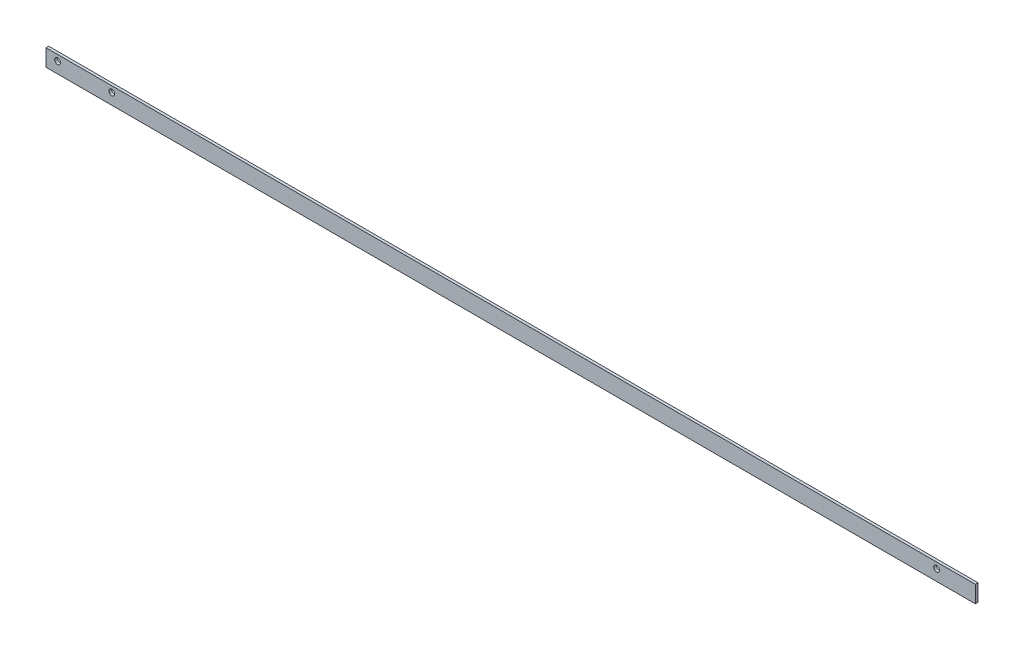
ISO-10303-21;
HEADER;
FILE_DESCRIPTION(('STEP AP214'),'2;1');
FILE_NAME('part.step','',(''),(''),'','','');
FILE_SCHEMA(('AUTOMOTIVE_DESIGN { 1 0 10303 214 1 1 1 1 }'));
ENDSEC;
DATA;
#1=APPLICATION_CONTEXT('core data for automotive mechanical design processes');
#2=APPLICATION_PROTOCOL_DEFINITION('international standard','automotive_design',2000,#1);
#3=PRODUCT_CONTEXT('',#1,'mechanical');
#4=PRODUCT('Part','Part','',(#3));
#5=PRODUCT_RELATED_PRODUCT_CATEGORY('part','',(#4));
#6=PRODUCT_DEFINITION_FORMATION('','',#4);
#7=PRODUCT_DEFINITION_CONTEXT('part definition',#1,'design');
#8=PRODUCT_DEFINITION('design','',#6,#7);
#9=PRODUCT_DEFINITION_SHAPE('','',#8);
#10=(LENGTH_UNIT() NAMED_UNIT(*) SI_UNIT(.MILLI.,.METRE.));
#11=(NAMED_UNIT(*) PLANE_ANGLE_UNIT() SI_UNIT($,.RADIAN.));
#12=(NAMED_UNIT(*) SI_UNIT($,.STERADIAN.) SOLID_ANGLE_UNIT());
#13=UNCERTAINTY_MEASURE_WITH_UNIT(LENGTH_MEASURE(1.E-05),#10,'distance_accuracy_value','');
#14=(GEOMETRIC_REPRESENTATION_CONTEXT(3) GLOBAL_UNCERTAINTY_ASSIGNED_CONTEXT((#13)) GLOBAL_UNIT_ASSIGNED_CONTEXT((#10,
#11,#12)) REPRESENTATION_CONTEXT('',''));
#15=CARTESIAN_POINT('',(0.,0.,0.));
#16=DIRECTION('',(0.,0.,1.));
#17=DIRECTION('',(1.,0.,0.));
#18=AXIS2_PLACEMENT_3D('',#15,#16,#17);
#19=CARTESIAN_POINT('',(304.800000000001,-5.54990000000001,0.889));
#20=DIRECTION('',(-1.,0.,0.));
#21=DIRECTION('',(0.,0.,1.));
#22=AXIS2_PLACEMENT_3D('',#19,#20,#21);
#23=PLANE('',#22);
#24=DIRECTION('',(0.,1.,0.));
#25=VECTOR('',#24,1.);
#26=CARTESIAN_POINT('',(304.800000000001,-5.54990000000001,-0.889));
#27=LINE('',#26,#25);
#28=CARTESIAN_POINT('',(304.800000000001,-5.54990000000001,-0.889));
#29=VERTEX_POINT('',#28);
#30=CARTESIAN_POINT('',(304.800000000001,5.54989999999998,-0.889));
#31=VERTEX_POINT('',#30);
#32=EDGE_CURVE('E110',#29,#31,#27,.T.);
#33=ORIENTED_EDGE('',*,*,#32,.T.);
#34=DIRECTION('',(0.,0.,-1.));
#35=VECTOR('',#34,1.);
#36=CARTESIAN_POINT('',(304.800000000001,5.54989999999998,0.889));
#37=LINE('',#36,#35);
#38=CARTESIAN_POINT('',(304.800000000001,5.54989999999998,0.889));
#39=VERTEX_POINT('',#38);
#40=EDGE_CURVE('E11',#39,#31,#37,.T.);
#41=ORIENTED_EDGE('',*,*,#40,.F.);
#42=DIRECTION('',(0.,1.,0.));
#43=VECTOR('',#42,1.);
#44=CARTESIAN_POINT('',(304.800000000001,-5.54990000000001,0.889));
#45=LINE('',#44,#43);
#46=CARTESIAN_POINT('',(304.800000000001,-5.54990000000001,0.889));
#47=VERTEX_POINT('',#46);
#48=EDGE_CURVE('E94',#47,#39,#45,.T.);
#49=ORIENTED_EDGE('',*,*,#48,.F.);
#50=DIRECTION('',(0.,0.,-1.));
#51=VECTOR('',#50,1.);
#52=CARTESIAN_POINT('',(304.800000000001,-5.54990000000001,0.889));
#53=LINE('',#52,#51);
#54=EDGE_CURVE('E106',#47,#29,#53,.T.);
#55=ORIENTED_EDGE('',*,*,#54,.T.);
#56=EDGE_LOOP('',(#33,#41,#49,#55));
#57=FACE_BOUND('',#56,.T.);
#58=ADVANCED_FACE('F42',(#57),#23,.F.);
#59=CARTESIAN_POINT('',(-304.799999999999,5.54989999999998,0.889));
#60=DIRECTION('',(0.,-1.,0.));
#61=DIRECTION('',(0.,0.,-1.));
#62=AXIS2_PLACEMENT_3D('',#59,#60,#61);
#63=PLANE('',#62);
#64=DIRECTION('',(-1.,0.,0.));
#65=VECTOR('',#64,1.);
#66=CARTESIAN_POINT('',(-304.799999999999,5.54989999999998,-0.889));
#67=LINE('',#66,#65);
#68=CARTESIAN_POINT('',(-304.799999999999,5.54989999999998,-0.889));
#69=VERTEX_POINT('',#68);
#70=EDGE_CURVE('E99',#31,#69,#67,.T.);
#71=ORIENTED_EDGE('',*,*,#70,.T.);
#72=DIRECTION('',(0.,0.,-1.));
#73=VECTOR('',#72,1.);
#74=CARTESIAN_POINT('',(-304.799999999999,5.54989999999998,0.889));
#75=LINE('',#74,#73);
#76=CARTESIAN_POINT('',(-304.799999999999,5.54989999999998,0.889));
#77=VERTEX_POINT('',#76);
#78=EDGE_CURVE('E51',#77,#69,#75,.T.);
#79=ORIENTED_EDGE('',*,*,#78,.F.);
#80=DIRECTION('',(-1.,0.,0.));
#81=VECTOR('',#80,1.);
#82=CARTESIAN_POINT('',(-304.799999999999,5.54989999999998,0.889));
#83=LINE('',#82,#81);
#84=EDGE_CURVE('E89',#39,#77,#83,.T.);
#85=ORIENTED_EDGE('',*,*,#84,.F.);
#86=ORIENTED_EDGE('',*,*,#40,.T.);
#87=EDGE_LOOP('',(#71,#79,#85,#86));
#88=FACE_BOUND('',#87,.T.);
#89=ADVANCED_FACE('F98',(#88),#63,.F.);
#90=CARTESIAN_POINT('',(-304.799999999999,-5.54989999999998,0.889));
#91=DIRECTION('',(1.,0.,0.));
#92=DIRECTION('',(0.,0.,-1.));
#93=AXIS2_PLACEMENT_3D('',#90,#91,#92);
#94=PLANE('',#93);
#95=DIRECTION('',(0.,-1.,0.));
#96=VECTOR('',#95,1.);
#97=CARTESIAN_POINT('',(-304.799999999999,-5.54989999999998,-0.889));
#98=LINE('',#97,#96);
#99=CARTESIAN_POINT('',(-304.799999999999,-5.54989999999998,-0.889));
#100=VERTEX_POINT('',#99);
#101=EDGE_CURVE('E76',#69,#100,#98,.T.);
#102=ORIENTED_EDGE('',*,*,#101,.T.);
#103=DIRECTION('',(0.,0.,-1.));
#104=VECTOR('',#103,1.);
#105=CARTESIAN_POINT('',(-304.799999999999,-5.54989999999998,0.889));
#106=LINE('',#105,#104);
#107=CARTESIAN_POINT('',(-304.799999999999,-5.54989999999998,0.889));
#108=VERTEX_POINT('',#107);
#109=EDGE_CURVE('E101',#108,#100,#106,.T.);
#110=ORIENTED_EDGE('',*,*,#109,.F.);
#111=DIRECTION('',(0.,-1.,0.));
#112=VECTOR('',#111,1.);
#113=CARTESIAN_POINT('',(-304.799999999999,-5.54989999999998,0.889));
#114=LINE('',#113,#112);
#115=EDGE_CURVE('E92',#77,#108,#114,.T.);
#116=ORIENTED_EDGE('',*,*,#115,.F.);
#117=ORIENTED_EDGE('',*,*,#78,.T.);
#118=EDGE_LOOP('',(#102,#110,#116,#117));
#119=FACE_BOUND('',#118,.T.);
#120=ADVANCED_FACE('F102',(#119),#94,.F.);
#121=CARTESIAN_POINT('',(-304.799999999999,-5.54989999999998,0.889));
#122=DIRECTION('',(0.,1.,0.));
#123=DIRECTION('',(-1.,0.,0.));
#124=AXIS2_PLACEMENT_3D('',#121,#122,#123);
#125=PLANE('',#124);
#126=DIRECTION('',(1.,0.,0.));
#127=VECTOR('',#126,1.);
#128=CARTESIAN_POINT('',(-304.799999999999,-5.54989999999998,-0.889));
#129=LINE('',#128,#127);
#130=EDGE_CURVE('E82',#100,#29,#129,.T.);
#131=ORIENTED_EDGE('',*,*,#130,.T.);
#132=ORIENTED_EDGE('',*,*,#54,.F.);
#133=DIRECTION('',(1.,0.,0.));
#134=VECTOR('',#133,1.);
#135=CARTESIAN_POINT('',(-304.799999999999,-5.54989999999998,0.889));
#136=LINE('',#135,#134);
#137=EDGE_CURVE('E59',#108,#47,#136,.T.);
#138=ORIENTED_EDGE('',*,*,#137,.F.);
#139=ORIENTED_EDGE('',*,*,#109,.T.);
#140=EDGE_LOOP('',(#131,#132,#138,#139));
#141=FACE_BOUND('',#140,.T.);
#142=ADVANCED_FACE('F124',(#141),#125,.F.);
#143=CARTESIAN_POINT('',(0.,0.,0.889));
#144=DIRECTION('',(0.,0.,-1.));
#145=DIRECTION('',(-1.,0.,0.));
#146=AXIS2_PLACEMENT_3D('',#143,#144,#145);
#147=PLANE('',#146);
#148=CARTESIAN_POINT('',(-297.179999999999,1.73989999999998,0.889));
#149=DIRECTION('',(0.,0.,1.));
#150=DIRECTION('',(1.,0.,0.));
#151=AXIS2_PLACEMENT_3D('',#148,#149,#150);
#152=CIRCLE('',#151,1.89865);
#153=CARTESIAN_POINT('',(-295.281349999999,1.73989999999998,0.889));
#154=VERTEX_POINT('',#153);
#155=EDGE_CURVE('E150',#154,#154,#152,.T.);
#156=ORIENTED_EDGE('',*,*,#155,.F.);
#157=EDGE_LOOP('',(#156));
#158=FACE_BOUND('',#157,.T.);
#159=CARTESIAN_POINT('',(-261.619999999999,1.73989999999998,0.889));
#160=DIRECTION('',(0.,0.,1.));
#161=DIRECTION('',(1.,0.,0.));
#162=AXIS2_PLACEMENT_3D('',#159,#160,#161);
#163=CIRCLE('',#162,1.89865);
#164=CARTESIAN_POINT('',(-259.721349999999,1.73989999999998,0.889));
#165=VERTEX_POINT('',#164);
#166=EDGE_CURVE('E142',#165,#165,#163,.T.);
#167=ORIENTED_EDGE('',*,*,#166,.F.);
#168=EDGE_LOOP('',(#167));
#169=FACE_BOUND('',#168,.T.);
#170=CARTESIAN_POINT('',(279.400000000001,1.73989999999998,0.889));
#171=DIRECTION('',(0.,0.,1.));
#172=DIRECTION('',(1.,0.,0.));
#173=AXIS2_PLACEMENT_3D('',#170,#171,#172);
#174=CIRCLE('',#173,1.89865);
#175=CARTESIAN_POINT('',(281.298650000001,1.73989999999998,0.889));
#176=VERTEX_POINT('',#175);
#177=EDGE_CURVE('E134',#176,#176,#174,.T.);
#178=ORIENTED_EDGE('',*,*,#177,.F.);
#179=EDGE_LOOP('',(#178));
#180=FACE_BOUND('',#179,.T.);
#181=ORIENTED_EDGE('',*,*,#48,.T.);
#182=ORIENTED_EDGE('',*,*,#84,.T.);
#183=ORIENTED_EDGE('',*,*,#115,.T.);
#184=ORIENTED_EDGE('',*,*,#137,.T.);
#185=EDGE_LOOP('',(#181,#182,#183,#184));
#186=FACE_BOUND('',#185,.T.);
#187=ADVANCED_FACE('F90',(#158,#169,#180,#186),#147,.F.);
#188=CARTESIAN_POINT('',(0.,0.,-0.889));
#189=DIRECTION('',(0.,0.,-1.));
#190=DIRECTION('',(-1.,0.,0.));
#191=AXIS2_PLACEMENT_3D('',#188,#189,#190);
#192=PLANE('',#191);
#193=CARTESIAN_POINT('',(-297.179999999999,1.73989999999998,-0.889));
#194=DIRECTION('',(0.,0.,1.));
#195=DIRECTION('',(1.,0.,0.));
#196=AXIS2_PLACEMENT_3D('',#193,#194,#195);
#197=CIRCLE('',#196,1.89865);
#198=CARTESIAN_POINT('',(-295.281349999999,1.73989999999998,-0.889));
#199=VERTEX_POINT('',#198);
#200=EDGE_CURVE('E146',#199,#199,#197,.T.);
#201=ORIENTED_EDGE('',*,*,#200,.T.);
#202=EDGE_LOOP('',(#201));
#203=FACE_BOUND('',#202,.T.);
#204=CARTESIAN_POINT('',(-261.619999999999,1.73989999999998,-0.889));
#205=DIRECTION('',(0.,0.,1.));
#206=DIRECTION('',(1.,0.,0.));
#207=AXIS2_PLACEMENT_3D('',#204,#205,#206);
#208=CIRCLE('',#207,1.89865);
#209=CARTESIAN_POINT('',(-259.721349999999,1.73989999999998,-0.889));
#210=VERTEX_POINT('',#209);
#211=EDGE_CURVE('E138',#210,#210,#208,.T.);
#212=ORIENTED_EDGE('',*,*,#211,.T.);
#213=EDGE_LOOP('',(#212));
#214=FACE_BOUND('',#213,.T.);
#215=CARTESIAN_POINT('',(279.400000000001,1.73989999999998,-0.889));
#216=DIRECTION('',(0.,0.,1.));
#217=DIRECTION('',(1.,0.,0.));
#218=AXIS2_PLACEMENT_3D('',#215,#216,#217);
#219=CIRCLE('',#218,1.89865);
#220=CARTESIAN_POINT('',(281.298650000001,1.73989999999998,-0.889));
#221=VERTEX_POINT('',#220);
#222=EDGE_CURVE('E114',#221,#221,#219,.T.);
#223=ORIENTED_EDGE('',*,*,#222,.T.);
#224=EDGE_LOOP('',(#223));
#225=FACE_BOUND('',#224,.T.);
#226=ORIENTED_EDGE('',*,*,#32,.F.);
#227=ORIENTED_EDGE('',*,*,#130,.F.);
#228=ORIENTED_EDGE('',*,*,#101,.F.);
#229=ORIENTED_EDGE('',*,*,#70,.F.);
#230=EDGE_LOOP('',(#226,#227,#228,#229));
#231=FACE_BOUND('',#230,.T.);
#232=ADVANCED_FACE('F127',(#203,#214,#225,#231),#192,.T.);
#233=CARTESIAN_POINT('',(279.400000000001,1.73989999999998,0.889));
#234=DIRECTION('',(0.,0.,1.));
#235=DIRECTION('',(1.,0.,0.));
#236=AXIS2_PLACEMENT_3D('',#233,#234,#235);
#237=CYLINDRICAL_SURFACE('',#236,1.89865);
#238=ORIENTED_EDGE('',*,*,#222,.F.);
#239=EDGE_LOOP('',(#238));
#240=FACE_BOUND('',#239,.T.);
#241=ORIENTED_EDGE('',*,*,#177,.T.);
#242=EDGE_LOOP('',(#241));
#243=FACE_BOUND('',#242,.T.);
#244=ADVANCED_FACE('F164',(#240,#243),#237,.F.);
#245=CARTESIAN_POINT('',(-261.619999999999,1.73989999999998,0.889));
#246=DIRECTION('',(0.,0.,1.));
#247=DIRECTION('',(1.,0.,0.));
#248=AXIS2_PLACEMENT_3D('',#245,#246,#247);
#249=CYLINDRICAL_SURFACE('',#248,1.89865);
#250=ORIENTED_EDGE('',*,*,#211,.F.);
#251=EDGE_LOOP('',(#250));
#252=FACE_BOUND('',#251,.T.);
#253=ORIENTED_EDGE('',*,*,#166,.T.);
#254=EDGE_LOOP('',(#253));
#255=FACE_BOUND('',#254,.T.);
#256=ADVANCED_FACE('F166',(#252,#255),#249,.F.);
#257=CARTESIAN_POINT('',(-297.179999999999,1.73989999999998,0.889));
#258=DIRECTION('',(0.,0.,1.));
#259=DIRECTION('',(1.,0.,0.));
#260=AXIS2_PLACEMENT_3D('',#257,#258,#259);
#261=CYLINDRICAL_SURFACE('',#260,1.89865);
#262=ORIENTED_EDGE('',*,*,#200,.F.);
#263=EDGE_LOOP('',(#262));
#264=FACE_BOUND('',#263,.T.);
#265=ORIENTED_EDGE('',*,*,#155,.T.);
#266=EDGE_LOOP('',(#265));
#267=FACE_BOUND('',#266,.T.);
#268=ADVANCED_FACE('F155',(#264,#267),#261,.F.);
#269=CLOSED_SHELL('',(#58,#89,#120,#142,#187,#232,#244,#256,#268));
#270=MANIFOLD_SOLID_BREP('B2',#269);
#271=ADVANCED_BREP_SHAPE_REPRESENTATION('',(#18,#270),#14);
#272=SHAPE_DEFINITION_REPRESENTATION(#9,#271);
ENDSEC;
END-ISO-10303-21;
